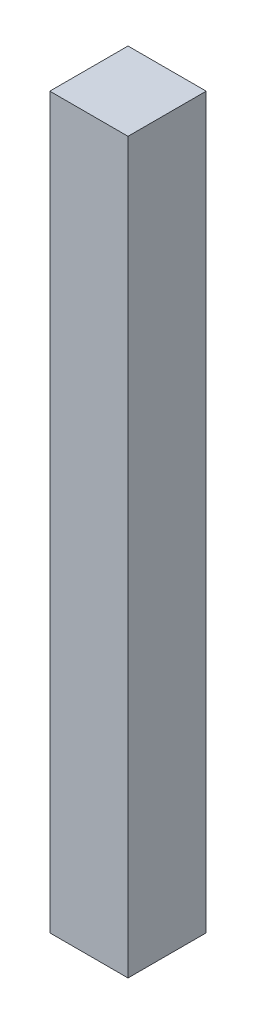
ISO-10303-21;
HEADER;
FILE_DESCRIPTION(('STEP AP214'),'2;1');
FILE_NAME('part.step','',(''),(''),'','','');
FILE_SCHEMA(('AUTOMOTIVE_DESIGN { 1 0 10303 214 1 1 1 1 }'));
ENDSEC;
DATA;
#1=APPLICATION_CONTEXT('core data for automotive mechanical design processes');
#2=APPLICATION_PROTOCOL_DEFINITION('international standard','automotive_design',2000,#1);
#3=PRODUCT_CONTEXT('',#1,'mechanical');
#4=PRODUCT('Part','Part','',(#3));
#5=PRODUCT_RELATED_PRODUCT_CATEGORY('part','',(#4));
#6=PRODUCT_DEFINITION_FORMATION('','',#4);
#7=PRODUCT_DEFINITION_CONTEXT('part definition',#1,'design');
#8=PRODUCT_DEFINITION('design','',#6,#7);
#9=PRODUCT_DEFINITION_SHAPE('','',#8);
#10=(LENGTH_UNIT() NAMED_UNIT(*) SI_UNIT(.MILLI.,.METRE.));
#11=(NAMED_UNIT(*) PLANE_ANGLE_UNIT() SI_UNIT($,.RADIAN.));
#12=(NAMED_UNIT(*) SI_UNIT($,.STERADIAN.) SOLID_ANGLE_UNIT());
#13=UNCERTAINTY_MEASURE_WITH_UNIT(LENGTH_MEASURE(1.E-05),#10,'distance_accuracy_value','');
#14=(GEOMETRIC_REPRESENTATION_CONTEXT(3) GLOBAL_UNCERTAINTY_ASSIGNED_CONTEXT((#13)) GLOBAL_UNIT_ASSIGNED_CONTEXT((#10,
#11,#12)) REPRESENTATION_CONTEXT('',''));
#15=CARTESIAN_POINT('',(0.,0.,0.));
#16=DIRECTION('',(0.,0.,1.));
#17=DIRECTION('',(1.,0.,0.));
#18=AXIS2_PLACEMENT_3D('',#15,#16,#17);
#19=CARTESIAN_POINT('',(-508.,-828.675,1016.));
#20=DIRECTION('',(1.,0.,0.));
#21=DIRECTION('',(0.,0.,-1.));
#22=AXIS2_PLACEMENT_3D('',#19,#20,#21);
#23=PLANE('',#22);
#24=DIRECTION('',(0.,0.,-1.));
#25=VECTOR('',#24,1.);
#26=CARTESIAN_POINT('',(-508.,0.,1016.));
#27=LINE('',#26,#25);
#28=CARTESIAN_POINT('',(-508.,0.,1016.));
#29=VERTEX_POINT('',#28);
#30=CARTESIAN_POINT('',(-508.,0.,927.1));
#31=VERTEX_POINT('',#30);
#32=EDGE_CURVE('E99',#29,#31,#27,.T.);
#33=ORIENTED_EDGE('',*,*,#32,.T.);
#34=DIRECTION('',(0.,1.,0.));
#35=VECTOR('',#34,1.);
#36=CARTESIAN_POINT('',(-508.,-828.675,927.1));
#37=LINE('',#36,#35);
#38=CARTESIAN_POINT('',(-508.,-828.675,927.1));
#39=VERTEX_POINT('',#38);
#40=EDGE_CURVE('E11',#39,#31,#37,.T.);
#41=ORIENTED_EDGE('',*,*,#40,.F.);
#42=DIRECTION('',(0.,0.,-1.));
#43=VECTOR('',#42,1.);
#44=CARTESIAN_POINT('',(-508.,-828.675,1016.));
#45=LINE('',#44,#43);
#46=CARTESIAN_POINT('',(-508.,-828.675,1016.));
#47=VERTEX_POINT('',#46);
#48=EDGE_CURVE('E108',#47,#39,#45,.T.);
#49=ORIENTED_EDGE('',*,*,#48,.F.);
#50=DIRECTION('',(0.,1.,0.));
#51=VECTOR('',#50,1.);
#52=CARTESIAN_POINT('',(-508.,-828.675,1016.));
#53=LINE('',#52,#51);
#54=EDGE_CURVE('E113',#47,#29,#53,.T.);
#55=ORIENTED_EDGE('',*,*,#54,.T.);
#56=EDGE_LOOP('',(#33,#41,#49,#55));
#57=FACE_BOUND('',#56,.T.);
#58=ADVANCED_FACE('F38',(#57),#23,.F.);
#59=CARTESIAN_POINT('',(-508.,-828.675,927.1));
#60=DIRECTION('',(0.,0.,1.));
#61=DIRECTION('',(1.,0.,0.));
#62=AXIS2_PLACEMENT_3D('',#59,#60,#61);
#63=PLANE('',#62);
#64=DIRECTION('',(1.,0.,0.));
#65=VECTOR('',#64,1.);
#66=CARTESIAN_POINT('',(-508.,0.,927.1));
#67=LINE('',#66,#65);
#68=CARTESIAN_POINT('',(-419.1,0.,927.1));
#69=VERTEX_POINT('',#68);
#70=EDGE_CURVE('E103',#31,#69,#67,.T.);
#71=ORIENTED_EDGE('',*,*,#70,.T.);
#72=DIRECTION('',(0.,1.,0.));
#73=VECTOR('',#72,1.);
#74=CARTESIAN_POINT('',(-419.1,-828.675,927.1));
#75=LINE('',#74,#73);
#76=CARTESIAN_POINT('',(-419.1,-828.675,927.1));
#77=VERTEX_POINT('',#76);
#78=EDGE_CURVE('E46',#77,#69,#75,.T.);
#79=ORIENTED_EDGE('',*,*,#78,.F.);
#80=DIRECTION('',(1.,0.,0.));
#81=VECTOR('',#80,1.);
#82=CARTESIAN_POINT('',(-508.,-828.675,927.1));
#83=LINE('',#82,#81);
#84=EDGE_CURVE('E85',#39,#77,#83,.T.);
#85=ORIENTED_EDGE('',*,*,#84,.F.);
#86=ORIENTED_EDGE('',*,*,#40,.T.);
#87=EDGE_LOOP('',(#71,#79,#85,#86));
#88=FACE_BOUND('',#87,.T.);
#89=ADVANCED_FACE('F137',(#88),#63,.F.);
#90=CARTESIAN_POINT('',(-419.1,-828.675,1016.));
#91=DIRECTION('',(-1.,0.,0.));
#92=DIRECTION('',(0.,0.,1.));
#93=AXIS2_PLACEMENT_3D('',#90,#91,#92);
#94=PLANE('',#93);
#95=DIRECTION('',(0.,0.,1.));
#96=VECTOR('',#95,1.);
#97=CARTESIAN_POINT('',(-419.1,0.,1016.));
#98=LINE('',#97,#96);
#99=CARTESIAN_POINT('',(-419.1,0.,1016.));
#100=VERTEX_POINT('',#99);
#101=EDGE_CURVE('E72',#69,#100,#98,.T.);
#102=ORIENTED_EDGE('',*,*,#101,.T.);
#103=DIRECTION('',(0.,1.,0.));
#104=VECTOR('',#103,1.);
#105=CARTESIAN_POINT('',(-419.1,-828.675,1016.));
#106=LINE('',#105,#104);
#107=CARTESIAN_POINT('',(-419.1,-828.675,1016.));
#108=VERTEX_POINT('',#107);
#109=EDGE_CURVE('E119',#108,#100,#106,.T.);
#110=ORIENTED_EDGE('',*,*,#109,.F.);
#111=DIRECTION('',(0.,0.,1.));
#112=VECTOR('',#111,1.);
#113=CARTESIAN_POINT('',(-419.1,-828.675,1016.));
#114=LINE('',#113,#112);
#115=EDGE_CURVE('E111',#77,#108,#114,.T.);
#116=ORIENTED_EDGE('',*,*,#115,.F.);
#117=ORIENTED_EDGE('',*,*,#78,.T.);
#118=EDGE_LOOP('',(#102,#110,#116,#117));
#119=FACE_BOUND('',#118,.T.);
#120=ADVANCED_FACE('F121',(#119),#94,.F.);
#121=CARTESIAN_POINT('',(-508.,-828.675,1016.));
#122=DIRECTION('',(0.,0.,-1.));
#123=DIRECTION('',(-1.,0.,0.));
#124=AXIS2_PLACEMENT_3D('',#121,#122,#123);
#125=PLANE('',#124);
#126=DIRECTION('',(-1.,0.,0.));
#127=VECTOR('',#126,1.);
#128=CARTESIAN_POINT('',(-508.,0.,1016.));
#129=LINE('',#128,#127);
#130=EDGE_CURVE('E78',#100,#29,#129,.T.);
#131=ORIENTED_EDGE('',*,*,#130,.T.);
#132=ORIENTED_EDGE('',*,*,#54,.F.);
#133=DIRECTION('',(-1.,0.,0.));
#134=VECTOR('',#133,1.);
#135=CARTESIAN_POINT('',(-508.,-828.675,1016.));
#136=LINE('',#135,#134);
#137=EDGE_CURVE('E54',#108,#47,#136,.T.);
#138=ORIENTED_EDGE('',*,*,#137,.F.);
#139=ORIENTED_EDGE('',*,*,#109,.T.);
#140=EDGE_LOOP('',(#131,#132,#138,#139));
#141=FACE_BOUND('',#140,.T.);
#142=ADVANCED_FACE('F127',(#141),#125,.F.);
#143=CARTESIAN_POINT('',(0.,-828.675,0.));
#144=DIRECTION('',(0.,-1.,0.));
#145=DIRECTION('',(0.,0.,-1.));
#146=AXIS2_PLACEMENT_3D('',#143,#144,#145);
#147=PLANE('',#146);
#148=CARTESIAN_POINT('',(-463.55,-828.675,971.55));
#149=DIRECTION('',(0.,-1.,0.));
#150=DIRECTION('',(0.,0.,-1.));
#151=AXIS2_PLACEMENT_3D('',#148,#149,#150);
#152=CIRCLE('',#151,6.35000000000002);
#153=CARTESIAN_POINT('',(-463.55,-828.675,965.2));
#154=VERTEX_POINT('',#153);
#155=EDGE_CURVE('E100',#154,#154,#152,.T.);
#156=ORIENTED_EDGE('',*,*,#155,.F.);
#157=EDGE_LOOP('',(#156));
#158=FACE_BOUND('',#157,.T.);
#159=ORIENTED_EDGE('',*,*,#48,.T.);
#160=ORIENTED_EDGE('',*,*,#84,.T.);
#161=ORIENTED_EDGE('',*,*,#115,.T.);
#162=ORIENTED_EDGE('',*,*,#137,.T.);
#163=EDGE_LOOP('',(#159,#160,#161,#162));
#164=FACE_BOUND('',#163,.T.);
#165=ADVANCED_FACE('F129',(#158,#164),#147,.T.);
#166=CARTESIAN_POINT('',(0.,0.,0.));
#167=DIRECTION('',(0.,-1.,0.));
#168=DIRECTION('',(0.,0.,-1.));
#169=AXIS2_PLACEMENT_3D('',#166,#167,#168);
#170=PLANE('',#169);
#171=ORIENTED_EDGE('',*,*,#32,.F.);
#172=ORIENTED_EDGE('',*,*,#130,.F.);
#173=ORIENTED_EDGE('',*,*,#101,.F.);
#174=ORIENTED_EDGE('',*,*,#70,.F.);
#175=EDGE_LOOP('',(#171,#172,#173,#174));
#176=FACE_BOUND('',#175,.T.);
#177=ADVANCED_FACE('F93',(#176),#170,.F.);
#178=CARTESIAN_POINT('',(-463.55,-824.611,971.55));
#179=DIRECTION('',(0.,-1.,0.));
#180=DIRECTION('',(0.,0.,-1.));
#181=AXIS2_PLACEMENT_3D('',#178,#179,#180);
#182=CONICAL_SURFACE('',#181,6.35000000000002,1.02974425867665);
#183=CARTESIAN_POINT('',(-463.55,-820.795535069175,971.55));
#184=VERTEX_POINT('',#183);
#185=VERTEX_LOOP('',#184);
#186=FACE_BOUND('',#185,.T.);
#187=CARTESIAN_POINT('',(-463.55,-824.611,971.55));
#188=DIRECTION('',(0.,-1.,0.));
#189=DIRECTION('',(0.,0.,-1.));
#190=AXIS2_PLACEMENT_3D('',#187,#188,#189);
#191=CIRCLE('',#190,6.35000000000002);
#192=CARTESIAN_POINT('',(-463.55,-824.611,965.2));
#193=VERTEX_POINT('',#192);
#194=EDGE_CURVE('E97',#193,#193,#191,.T.);
#195=ORIENTED_EDGE('',*,*,#194,.T.);
#196=EDGE_LOOP('',(#195));
#197=FACE_BOUND('',#196,.T.);
#198=ADVANCED_FACE('F89',(#186,#197),#182,.F.);
#199=CARTESIAN_POINT('',(-463.55,-828.675,971.55));
#200=DIRECTION('',(0.,-1.,0.));
#201=DIRECTION('',(0.,0.,-1.));
#202=AXIS2_PLACEMENT_3D('',#199,#200,#201);
#203=CYLINDRICAL_SURFACE('',#202,6.35000000000002);
#204=ORIENTED_EDGE('',*,*,#194,.F.);
#205=EDGE_LOOP('',(#204));
#206=FACE_BOUND('',#205,.T.);
#207=ORIENTED_EDGE('',*,*,#155,.T.);
#208=EDGE_LOOP('',(#207));
#209=FACE_BOUND('',#208,.T.);
#210=ADVANCED_FACE('F92',(#206,#209),#203,.F.);
#211=CLOSED_SHELL('',(#58,#89,#120,#142,#165,#177,#198,#210));
#212=MANIFOLD_SOLID_BREP('B2',#211);
#213=ADVANCED_BREP_SHAPE_REPRESENTATION('',(#18,#212),#14);
#214=SHAPE_DEFINITION_REPRESENTATION(#9,#213);
ENDSEC;
END-ISO-10303-21;
